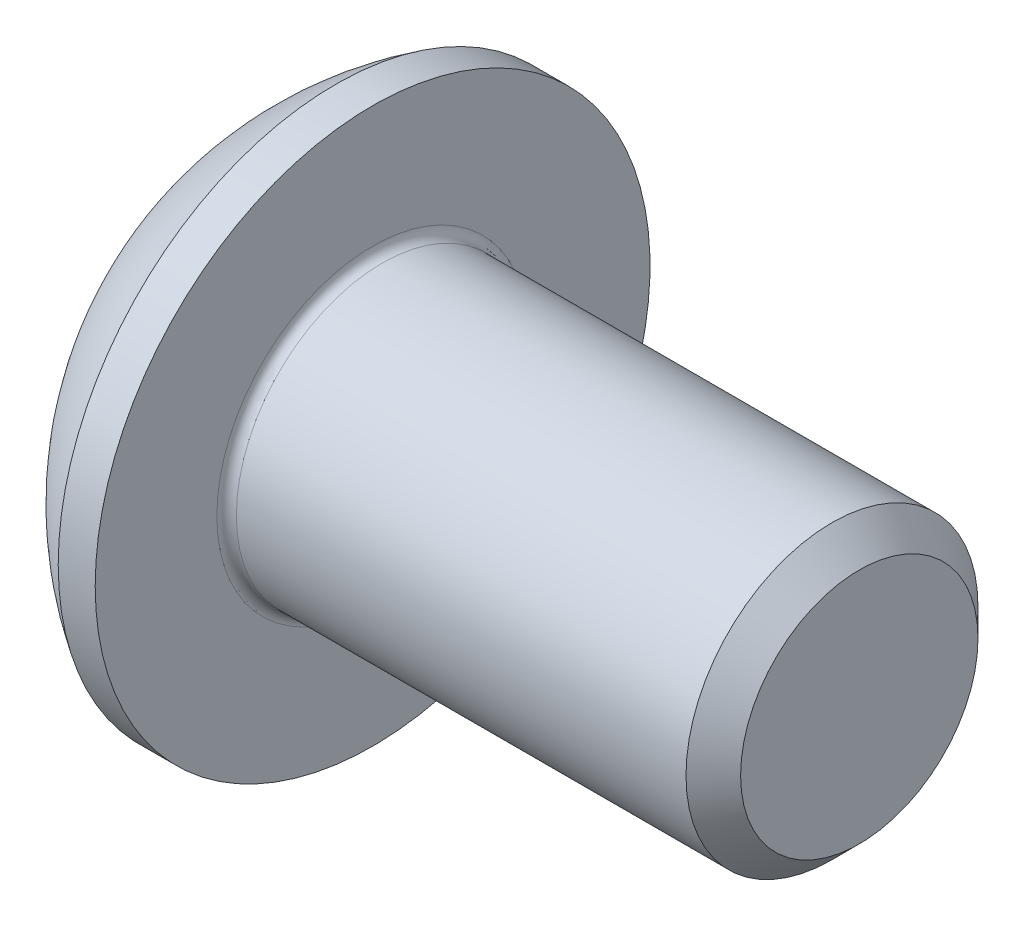
ISO-10303-21;
HEADER;
FILE_DESCRIPTION(('STEP AP214'),'2;1');
FILE_NAME('part.step','',(''),(''),'','','');
FILE_SCHEMA(('AUTOMOTIVE_DESIGN { 1 0 10303 214 1 1 1 1 }'));
ENDSEC;
DATA;
#1=APPLICATION_CONTEXT('core data for automotive mechanical design processes');
#2=APPLICATION_PROTOCOL_DEFINITION('international standard','automotive_design',2000,#1);
#3=PRODUCT_CONTEXT('',#1,'mechanical');
#4=PRODUCT('Part','Part','',(#3));
#5=PRODUCT_RELATED_PRODUCT_CATEGORY('part','',(#4));
#6=PRODUCT_DEFINITION_FORMATION('','',#4);
#7=PRODUCT_DEFINITION_CONTEXT('part definition',#1,'design');
#8=PRODUCT_DEFINITION('design','',#6,#7);
#9=PRODUCT_DEFINITION_SHAPE('','',#8);
#10=(LENGTH_UNIT() NAMED_UNIT(*) SI_UNIT(.MILLI.,.METRE.));
#11=(NAMED_UNIT(*) PLANE_ANGLE_UNIT() SI_UNIT($,.RADIAN.));
#12=(NAMED_UNIT(*) SI_UNIT($,.STERADIAN.) SOLID_ANGLE_UNIT());
#13=UNCERTAINTY_MEASURE_WITH_UNIT(LENGTH_MEASURE(1.E-05),#10,'distance_accuracy_value','');
#14=(GEOMETRIC_REPRESENTATION_CONTEXT(3) GLOBAL_UNCERTAINTY_ASSIGNED_CONTEXT((#13)) GLOBAL_UNIT_ASSIGNED_CONTEXT((#10,
#11,#12)) REPRESENTATION_CONTEXT('',''));
#15=CARTESIAN_POINT('',(0.,0.,0.));
#16=DIRECTION('',(0.,0.,1.));
#17=DIRECTION('',(1.,0.,0.));
#18=AXIS2_PLACEMENT_3D('',#15,#16,#17);
#19=CARTESIAN_POINT('',(0.,0.,0.));
#20=DIRECTION('',(-1.,0.,0.));
#21=DIRECTION('',(0.,0.,1.));
#22=AXIS2_PLACEMENT_3D('',#19,#20,#21);
#23=PLANE('',#22);
#24=CARTESIAN_POINT('',(0.,0.,0.));
#25=DIRECTION('',(-1.,0.,0.));
#26=DIRECTION('',(0.,0.,1.));
#27=AXIS2_PLACEMENT_3D('',#24,#25,#26);
#28=CIRCLE('',#27,1.425);
#29=CARTESIAN_POINT('',(0.,0.,1.425));
#30=VERTEX_POINT('',#29);
#31=EDGE_CURVE('E162',#30,#30,#28,.T.);
#32=ORIENTED_EDGE('',*,*,#31,.T.);
#33=EDGE_LOOP('',(#32));
#34=FACE_BOUND('',#33,.T.);
#35=DIRECTION('',(0.,-1.,0.));
#36=VECTOR('',#35,1.);
#37=CARTESIAN_POINT('',(0.,-0.577350269189625,1.));
#38=LINE('',#37,#36);
#39=CARTESIAN_POINT('',(0.,0.577350269189626,1.));
#40=VERTEX_POINT('',#39);
#41=CARTESIAN_POINT('',(0.,-0.577350269189625,1.));
#42=VERTEX_POINT('',#41);
#43=EDGE_CURVE('E52',#40,#42,#38,.T.);
#44=ORIENTED_EDGE('',*,*,#43,.T.);
#45=DIRECTION('',(0.,-0.5,-0.866025403784439));
#46=VECTOR('',#45,1.);
#47=CARTESIAN_POINT('',(0.,-1.15470053837925,0.));
#48=LINE('',#47,#46);
#49=CARTESIAN_POINT('',(0.,-1.15470053837925,0.));
#50=VERTEX_POINT('',#49);
#51=EDGE_CURVE('E255',#42,#50,#48,.T.);
#52=ORIENTED_EDGE('',*,*,#51,.T.);
#53=DIRECTION('',(0.,0.5,-0.866025403784439));
#54=VECTOR('',#53,1.);
#55=CARTESIAN_POINT('',(0.,-0.577350269189625,-1.));
#56=LINE('',#55,#54);
#57=CARTESIAN_POINT('',(0.,-0.577350269189625,-1.));
#58=VERTEX_POINT('',#57);
#59=EDGE_CURVE('E137',#50,#58,#56,.T.);
#60=ORIENTED_EDGE('',*,*,#59,.T.);
#61=DIRECTION('',(0.,1.,0.));
#62=VECTOR('',#61,1.);
#63=CARTESIAN_POINT('',(0.,0.577350269189626,-1.));
#64=LINE('',#63,#62);
#65=CARTESIAN_POINT('',(0.,0.577350269189626,-1.));
#66=VERTEX_POINT('',#65);
#67=EDGE_CURVE('E258',#58,#66,#64,.T.);
#68=ORIENTED_EDGE('',*,*,#67,.T.);
#69=DIRECTION('',(0.,0.5,0.866025403784438));
#70=VECTOR('',#69,1.);
#71=CARTESIAN_POINT('',(0.,1.15470053837925,0.));
#72=LINE('',#71,#70);
#73=CARTESIAN_POINT('',(0.,1.15470053837925,0.));
#74=VERTEX_POINT('',#73);
#75=EDGE_CURVE('E260',#66,#74,#72,.T.);
#76=ORIENTED_EDGE('',*,*,#75,.T.);
#77=DIRECTION('',(0.,-0.5,0.866025403784438));
#78=VECTOR('',#77,1.);
#79=CARTESIAN_POINT('',(0.,0.577350269189626,1.));
#80=LINE('',#79,#78);
#81=EDGE_CURVE('E262',#74,#40,#80,.T.);
#82=ORIENTED_EDGE('',*,*,#81,.T.);
#83=EDGE_LOOP('',(#44,#52,#60,#68,#76,#82));
#84=FACE_BOUND('',#83,.T.);
#85=ADVANCED_FACE('F37',(#34,#84),#23,.T.);
#86=CARTESIAN_POINT('',(3.03337598425197,0.,0.));
#87=DIRECTION('',(-1.,0.,0.));
#88=DIRECTION('',(0.,1.,0.));
#89=AXIS2_PLACEMENT_3D('',#86,#87,#88);
#90=SPHERICAL_SURFACE('',#89,3.35141684393878);
#91=CARTESIAN_POINT('',(1.27,0.,0.));
#92=DIRECTION('',(-1.,0.,0.));
#93=DIRECTION('',(0.,0.,1.));
#94=AXIS2_PLACEMENT_3D('',#91,#92,#93);
#95=CIRCLE('',#94,2.85);
#96=CARTESIAN_POINT('',(1.27,0.,2.85));
#97=VERTEX_POINT('',#96);
#98=EDGE_CURVE('E159',#97,#97,#95,.T.);
#99=ORIENTED_EDGE('',*,*,#98,.T.);
#100=EDGE_LOOP('',(#99));
#101=FACE_BOUND('',#100,.T.);
#102=ORIENTED_EDGE('',*,*,#31,.F.);
#103=EDGE_LOOP('',(#102));
#104=FACE_BOUND('',#103,.T.);
#105=ADVANCED_FACE('F183',(#101,#104),#90,.T.);
#106=CARTESIAN_POINT('',(0.,0.,0.));
#107=DIRECTION('',(-1.,0.,0.));
#108=DIRECTION('',(0.,0.,1.));
#109=AXIS2_PLACEMENT_3D('',#106,#107,#108);
#110=CYLINDRICAL_SURFACE('',#109,2.85);
#111=ORIENTED_EDGE('',*,*,#98,.F.);
#112=EDGE_LOOP('',(#111));
#113=FACE_BOUND('',#112,.T.);
#114=CARTESIAN_POINT('',(1.65,0.,0.));
#115=DIRECTION('',(-1.,0.,0.));
#116=DIRECTION('',(0.,0.,1.));
#117=AXIS2_PLACEMENT_3D('',#114,#115,#116);
#118=CIRCLE('',#117,2.85);
#119=CARTESIAN_POINT('',(1.65,0.,2.85));
#120=VERTEX_POINT('',#119);
#121=EDGE_CURVE('E156',#120,#120,#118,.T.);
#122=ORIENTED_EDGE('',*,*,#121,.T.);
#123=EDGE_LOOP('',(#122));
#124=FACE_BOUND('',#123,.T.);
#125=ADVANCED_FACE('F188',(#113,#124),#110,.T.);
#126=CARTESIAN_POINT('',(1.65,1.5,0.));
#127=DIRECTION('',(-1.,0.,0.));
#128=DIRECTION('',(0.,0.,1.));
#129=AXIS2_PLACEMENT_3D('',#126,#127,#128);
#130=PLANE('',#129);
#131=CARTESIAN_POINT('',(1.65,0.,0.));
#132=DIRECTION('',(-1.,0.,0.));
#133=DIRECTION('',(0.,0.,1.));
#134=AXIS2_PLACEMENT_3D('',#131,#132,#133);
#135=CIRCLE('',#134,1.6);
#136=CARTESIAN_POINT('',(1.65,0.,1.6));
#137=VERTEX_POINT('',#136);
#138=EDGE_CURVE('E45',#137,#137,#135,.T.);
#139=ORIENTED_EDGE('',*,*,#138,.T.);
#140=EDGE_LOOP('',(#139));
#141=FACE_BOUND('',#140,.T.);
#142=ORIENTED_EDGE('',*,*,#121,.F.);
#143=EDGE_LOOP('',(#142));
#144=FACE_BOUND('',#143,.T.);
#145=ADVANCED_FACE('F167',(#141,#144),#130,.F.);
#146=CARTESIAN_POINT('',(0.,0.,0.));
#147=DIRECTION('',(-1.,0.,0.));
#148=DIRECTION('',(0.,0.,1.));
#149=AXIS2_PLACEMENT_3D('',#146,#147,#148);
#150=CYLINDRICAL_SURFACE('',#149,1.5);
#151=CARTESIAN_POINT('',(1.75,0.,0.));
#152=DIRECTION('',(-1.,0.,0.));
#153=DIRECTION('',(0.,0.,1.));
#154=AXIS2_PLACEMENT_3D('',#151,#152,#153);
#155=CIRCLE('',#154,1.5);
#156=CARTESIAN_POINT('',(1.75,0.,1.5));
#157=VERTEX_POINT('',#156);
#158=EDGE_CURVE('E11',#157,#157,#155,.F.);
#159=ORIENTED_EDGE('',*,*,#158,.T.);
#160=EDGE_LOOP('',(#159));
#161=FACE_BOUND('',#160,.T.);
#162=CARTESIAN_POINT('',(6.3695,0.,0.));
#163=DIRECTION('',(-1.,0.,0.));
#164=DIRECTION('',(0.,0.,1.));
#165=AXIS2_PLACEMENT_3D('',#162,#163,#164);
#166=CIRCLE('',#165,1.5);
#167=CARTESIAN_POINT('',(6.3695,0.,1.5));
#168=VERTEX_POINT('',#167);
#169=EDGE_CURVE('E153',#168,#168,#166,.T.);
#170=ORIENTED_EDGE('',*,*,#169,.T.);
#171=EDGE_LOOP('',(#170));
#172=FACE_BOUND('',#171,.T.);
#173=ADVANCED_FACE('F197',(#161,#172),#150,.T.);
#174=CARTESIAN_POINT('',(6.65,0.,0.));
#175=DIRECTION('',(-1.,0.,0.));
#176=DIRECTION('',(0.,0.,1.));
#177=AXIS2_PLACEMENT_3D('',#174,#175,#176);
#178=CONICAL_SURFACE('',#177,1.2195,0.785398163397447);
#179=ORIENTED_EDGE('',*,*,#169,.F.);
#180=EDGE_LOOP('',(#179));
#181=FACE_BOUND('',#180,.T.);
#182=CARTESIAN_POINT('',(6.65,0.,0.));
#183=DIRECTION('',(-1.,0.,0.));
#184=DIRECTION('',(0.,0.,1.));
#185=AXIS2_PLACEMENT_3D('',#182,#183,#184);
#186=CIRCLE('',#185,1.2195);
#187=CARTESIAN_POINT('',(6.65,0.,1.2195));
#188=VERTEX_POINT('',#187);
#189=EDGE_CURVE('E149',#188,#188,#186,.T.);
#190=ORIENTED_EDGE('',*,*,#189,.T.);
#191=EDGE_LOOP('',(#190));
#192=FACE_BOUND('',#191,.T.);
#193=ADVANCED_FACE('F178',(#181,#192),#178,.T.);
#194=CARTESIAN_POINT('',(6.65,0.,0.));
#195=DIRECTION('',(-1.,0.,0.));
#196=DIRECTION('',(0.,0.,1.));
#197=AXIS2_PLACEMENT_3D('',#194,#195,#196);
#198=PLANE('',#197);
#199=ORIENTED_EDGE('',*,*,#189,.F.);
#200=EDGE_LOOP('',(#199));
#201=FACE_BOUND('',#200,.T.);
#202=ADVANCED_FACE('F171',(#201),#198,.F.);
#203=CARTESIAN_POINT('',(1.75,0.,0.));
#204=DIRECTION('',(-1.,0.,0.));
#205=DIRECTION('',(0.,0.,1.));
#206=AXIS2_PLACEMENT_3D('',#203,#204,#205);
#207=TOROIDAL_SURFACE('',#206,1.6,0.1);
#208=ORIENTED_EDGE('',*,*,#158,.F.);
#209=EDGE_LOOP('',(#208));
#210=FACE_BOUND('',#209,.T.);
#211=ORIENTED_EDGE('',*,*,#138,.F.);
#212=EDGE_LOOP('',(#211));
#213=FACE_BOUND('',#212,.T.);
#214=ADVANCED_FACE('F39',(#210,#213),#207,.F.);
#215=CARTESIAN_POINT('',(1.04,-1.15470053837925,0.));
#216=DIRECTION('',(0.,0.866025403784439,-0.5));
#217=DIRECTION('',(0.,0.5,0.866025403784439));
#218=AXIS2_PLACEMENT_3D('',#215,#216,#217);
#219=PLANE('',#218);
#220=DIRECTION('',(0.,-0.5,-0.866025403784439));
#221=VECTOR('',#220,1.);
#222=CARTESIAN_POINT('',(1.04,-1.15470053837925,0.));
#223=LINE('',#222,#221);
#224=CARTESIAN_POINT('',(1.04,-0.577350269189625,1.));
#225=VERTEX_POINT('',#224);
#226=CARTESIAN_POINT('',(1.04,-0.866025403784438,0.5));
#227=VERTEX_POINT('',#226);
#228=EDGE_CURVE('E120',#225,#227,#223,.T.);
#229=ORIENTED_EDGE('',*,*,#228,.T.);
#230=CARTESIAN_POINT('',(1.04,-1.15470053837925,0.));
#231=VERTEX_POINT('',#230);
#232=EDGE_CURVE('E113',#227,#231,#223,.T.);
#233=ORIENTED_EDGE('',*,*,#232,.T.);
#234=DIRECTION('',(-1.,0.,0.));
#235=VECTOR('',#234,1.);
#236=CARTESIAN_POINT('',(1.04,-1.15470053837925,0.));
#237=LINE('',#236,#235);
#238=EDGE_CURVE('E117',#231,#50,#237,.T.);
#239=ORIENTED_EDGE('',*,*,#238,.T.);
#240=ORIENTED_EDGE('',*,*,#51,.F.);
#241=DIRECTION('',(-1.,0.,0.));
#242=VECTOR('',#241,1.);
#243=CARTESIAN_POINT('',(1.04,-0.577350269189625,1.));
#244=LINE('',#243,#242);
#245=EDGE_CURVE('E245',#225,#42,#244,.T.);
#246=ORIENTED_EDGE('',*,*,#245,.F.);
#247=EDGE_LOOP('',(#229,#233,#239,#240,#246));
#248=FACE_BOUND('',#247,.T.);
#249=ADVANCED_FACE('F115',(#248),#219,.T.);
#250=CARTESIAN_POINT('',(1.04,-0.577350269189625,-1.));
#251=DIRECTION('',(0.,0.866025403784439,0.5));
#252=DIRECTION('',(0.,-0.5,0.866025403784439));
#253=AXIS2_PLACEMENT_3D('',#250,#251,#252);
#254=PLANE('',#253);
#255=DIRECTION('',(0.,0.5,-0.866025403784439));
#256=VECTOR('',#255,1.);
#257=CARTESIAN_POINT('',(1.04,-0.577350269189625,-1.));
#258=LINE('',#257,#256);
#259=CARTESIAN_POINT('',(1.04,-0.866025403784438,-0.5));
#260=VERTEX_POINT('',#259);
#261=EDGE_CURVE('E125',#231,#260,#258,.T.);
#262=ORIENTED_EDGE('',*,*,#261,.T.);
#263=CARTESIAN_POINT('',(1.04,-0.577350269189625,-1.));
#264=VERTEX_POINT('',#263);
#265=EDGE_CURVE('E132',#260,#264,#258,.T.);
#266=ORIENTED_EDGE('',*,*,#265,.T.);
#267=DIRECTION('',(-1.,0.,0.));
#268=VECTOR('',#267,1.);
#269=CARTESIAN_POINT('',(1.04,-0.577350269189625,-1.));
#270=LINE('',#269,#268);
#271=EDGE_CURVE('E139',#264,#58,#270,.T.);
#272=ORIENTED_EDGE('',*,*,#271,.T.);
#273=ORIENTED_EDGE('',*,*,#59,.F.);
#274=ORIENTED_EDGE('',*,*,#238,.F.);
#275=EDGE_LOOP('',(#262,#266,#272,#273,#274));
#276=FACE_BOUND('',#275,.T.);
#277=ADVANCED_FACE('F135',(#276),#254,.T.);
#278=CARTESIAN_POINT('',(1.04,0.577350269189626,-1.));
#279=DIRECTION('',(0.,0.,1.));
#280=DIRECTION('',(1.,0.,0.));
#281=AXIS2_PLACEMENT_3D('',#278,#279,#280);
#282=PLANE('',#281);
#283=DIRECTION('',(0.,1.,0.));
#284=VECTOR('',#283,1.);
#285=CARTESIAN_POINT('',(1.04,0.577350269189626,-1.));
#286=LINE('',#285,#284);
#287=CARTESIAN_POINT('',(1.04,0.,-1.));
#288=VERTEX_POINT('',#287);
#289=EDGE_CURVE('E281',#264,#288,#286,.T.);
#290=ORIENTED_EDGE('',*,*,#289,.T.);
#291=CARTESIAN_POINT('',(1.04,0.577350269189626,-1.));
#292=VERTEX_POINT('',#291);
#293=EDGE_CURVE('E131',#288,#292,#286,.T.);
#294=ORIENTED_EDGE('',*,*,#293,.T.);
#295=DIRECTION('',(-1.,0.,0.));
#296=VECTOR('',#295,1.);
#297=CARTESIAN_POINT('',(1.04,0.577350269189626,-1.));
#298=LINE('',#297,#296);
#299=EDGE_CURVE('E144',#292,#66,#298,.T.);
#300=ORIENTED_EDGE('',*,*,#299,.T.);
#301=ORIENTED_EDGE('',*,*,#67,.F.);
#302=ORIENTED_EDGE('',*,*,#271,.F.);
#303=EDGE_LOOP('',(#290,#294,#300,#301,#302));
#304=FACE_BOUND('',#303,.T.);
#305=ADVANCED_FACE('F211',(#304),#282,.T.);
#306=CARTESIAN_POINT('',(1.04,1.15470053837925,0.));
#307=DIRECTION('',(0.,-0.866025403784438,0.5));
#308=DIRECTION('',(0.,-0.5,-0.866025403784439));
#309=AXIS2_PLACEMENT_3D('',#306,#307,#308);
#310=PLANE('',#309);
#311=DIRECTION('',(0.,0.5,0.866025403784438));
#312=VECTOR('',#311,1.);
#313=CARTESIAN_POINT('',(1.04,1.15470053837925,0.));
#314=LINE('',#313,#312);
#315=CARTESIAN_POINT('',(1.04,0.866025403784439,-0.5));
#316=VERTEX_POINT('',#315);
#317=EDGE_CURVE('E287',#292,#316,#314,.T.);
#318=ORIENTED_EDGE('',*,*,#317,.T.);
#319=CARTESIAN_POINT('',(1.04,1.15470053837925,0.));
#320=VERTEX_POINT('',#319);
#321=EDGE_CURVE('E285',#316,#320,#314,.T.);
#322=ORIENTED_EDGE('',*,*,#321,.T.);
#323=DIRECTION('',(-1.,0.,0.));
#324=VECTOR('',#323,1.);
#325=CARTESIAN_POINT('',(1.04,1.15470053837925,0.));
#326=LINE('',#325,#324);
#327=EDGE_CURVE('E267',#320,#74,#326,.T.);
#328=ORIENTED_EDGE('',*,*,#327,.T.);
#329=ORIENTED_EDGE('',*,*,#75,.F.);
#330=ORIENTED_EDGE('',*,*,#299,.F.);
#331=EDGE_LOOP('',(#318,#322,#328,#329,#330));
#332=FACE_BOUND('',#331,.T.);
#333=ADVANCED_FACE('F214',(#332),#310,.T.);
#334=CARTESIAN_POINT('',(1.04,0.577350269189626,1.));
#335=DIRECTION('',(0.,-0.866025403784439,-0.5));
#336=DIRECTION('',(0.,0.5,-0.866025403784438));
#337=AXIS2_PLACEMENT_3D('',#334,#335,#336);
#338=PLANE('',#337);
#339=DIRECTION('',(0.,-0.5,0.866025403784438));
#340=VECTOR('',#339,1.);
#341=CARTESIAN_POINT('',(1.04,0.577350269189626,1.));
#342=LINE('',#341,#340);
#343=CARTESIAN_POINT('',(1.04,0.866025403784439,0.500000000000001));
#344=VERTEX_POINT('',#343);
#345=EDGE_CURVE('E251',#320,#344,#342,.T.);
#346=ORIENTED_EDGE('',*,*,#345,.T.);
#347=CARTESIAN_POINT('',(1.04,0.577350269189626,1.));
#348=VERTEX_POINT('',#347);
#349=EDGE_CURVE('E243',#344,#348,#342,.T.);
#350=ORIENTED_EDGE('',*,*,#349,.T.);
#351=DIRECTION('',(-1.,0.,0.));
#352=VECTOR('',#351,1.);
#353=CARTESIAN_POINT('',(1.04,0.577350269189626,1.));
#354=LINE('',#353,#352);
#355=EDGE_CURVE('E249',#348,#40,#354,.T.);
#356=ORIENTED_EDGE('',*,*,#355,.T.);
#357=ORIENTED_EDGE('',*,*,#81,.F.);
#358=ORIENTED_EDGE('',*,*,#327,.F.);
#359=EDGE_LOOP('',(#346,#350,#356,#357,#358));
#360=FACE_BOUND('',#359,.T.);
#361=ADVANCED_FACE('F218',(#360),#338,.T.);
#362=CARTESIAN_POINT('',(1.04,-0.577350269189625,1.));
#363=DIRECTION('',(0.,0.,-1.));
#364=DIRECTION('',(-1.,0.,0.));
#365=AXIS2_PLACEMENT_3D('',#362,#363,#364);
#366=PLANE('',#365);
#367=DIRECTION('',(0.,-1.,0.));
#368=VECTOR('',#367,1.);
#369=CARTESIAN_POINT('',(1.04,-0.577350269189625,1.));
#370=LINE('',#369,#368);
#371=CARTESIAN_POINT('',(1.04,0.,1.));
#372=VERTEX_POINT('',#371);
#373=EDGE_CURVE('E60',#348,#372,#370,.T.);
#374=ORIENTED_EDGE('',*,*,#373,.T.);
#375=EDGE_CURVE('E246',#372,#225,#370,.T.);
#376=ORIENTED_EDGE('',*,*,#375,.T.);
#377=ORIENTED_EDGE('',*,*,#245,.T.);
#378=ORIENTED_EDGE('',*,*,#43,.F.);
#379=ORIENTED_EDGE('',*,*,#355,.F.);
#380=EDGE_LOOP('',(#374,#376,#377,#378,#379));
#381=FACE_BOUND('',#380,.T.);
#382=ADVANCED_FACE('F222',(#381),#366,.T.);
#383=CARTESIAN_POINT('',(1.04,0.,2.));
#384=DIRECTION('',(-1.,0.,0.));
#385=DIRECTION('',(0.,0.,1.));
#386=AXIS2_PLACEMENT_3D('',#383,#384,#385);
#387=PLANE('',#386);
#388=ORIENTED_EDGE('',*,*,#373,.F.);
#389=ORIENTED_EDGE('',*,*,#349,.F.);
#390=CARTESIAN_POINT('',(1.04,0.,0.));
#391=DIRECTION('',(-1.,0.,0.));
#392=DIRECTION('',(0.,0.,1.));
#393=AXIS2_PLACEMENT_3D('',#390,#391,#392);
#394=CIRCLE('',#393,1.);
#395=EDGE_CURVE('E143',#372,#344,#394,.T.);
#396=ORIENTED_EDGE('',*,*,#395,.F.);
#397=EDGE_LOOP('',(#388,#389,#396));
#398=FACE_BOUND('',#397,.T.);
#399=ADVANCED_FACE('F226',(#398),#387,.T.);
#400=ORIENTED_EDGE('',*,*,#345,.F.);
#401=ORIENTED_EDGE('',*,*,#321,.F.);
#402=EDGE_CURVE('E150',#344,#316,#394,.T.);
#403=ORIENTED_EDGE('',*,*,#402,.F.);
#404=EDGE_LOOP('',(#400,#401,#403));
#405=FACE_BOUND('',#404,.T.);
#406=ADVANCED_FACE('F234',(#405),#387,.T.);
#407=ORIENTED_EDGE('',*,*,#317,.F.);
#408=ORIENTED_EDGE('',*,*,#293,.F.);
#409=EDGE_CURVE('E292',#316,#288,#394,.T.);
#410=ORIENTED_EDGE('',*,*,#409,.F.);
#411=EDGE_LOOP('',(#407,#408,#410));
#412=FACE_BOUND('',#411,.T.);
#413=ADVANCED_FACE('F239',(#412),#387,.T.);
#414=ORIENTED_EDGE('',*,*,#289,.F.);
#415=ORIENTED_EDGE('',*,*,#265,.F.);
#416=EDGE_CURVE('E284',#288,#260,#394,.T.);
#417=ORIENTED_EDGE('',*,*,#416,.F.);
#418=EDGE_LOOP('',(#414,#415,#417));
#419=FACE_BOUND('',#418,.T.);
#420=ADVANCED_FACE('F232',(#419),#387,.T.);
#421=ORIENTED_EDGE('',*,*,#261,.F.);
#422=ORIENTED_EDGE('',*,*,#232,.F.);
#423=EDGE_CURVE('E127',#260,#227,#394,.T.);
#424=ORIENTED_EDGE('',*,*,#423,.F.);
#425=EDGE_LOOP('',(#421,#422,#424));
#426=FACE_BOUND('',#425,.T.);
#427=ADVANCED_FACE('F126',(#426),#387,.T.);
#428=ORIENTED_EDGE('',*,*,#228,.F.);
#429=ORIENTED_EDGE('',*,*,#375,.F.);
#430=EDGE_CURVE('E138',#227,#372,#394,.T.);
#431=ORIENTED_EDGE('',*,*,#430,.F.);
#432=EDGE_LOOP('',(#428,#429,#431));
#433=FACE_BOUND('',#432,.T.);
#434=ADVANCED_FACE('F206',(#433),#387,.T.);
#435=CARTESIAN_POINT('',(1.61735026918963,0.,0.));
#436=DIRECTION('',(-1.,0.,0.));
#437=DIRECTION('',(0.,0.,1.));
#438=AXIS2_PLACEMENT_3D('',#435,#436,#437);
#439=CONICAL_SURFACE('',#438,0.,1.04719755119659);
#440=ORIENTED_EDGE('',*,*,#395,.T.);
#441=ORIENTED_EDGE('',*,*,#402,.T.);
#442=ORIENTED_EDGE('',*,*,#409,.T.);
#443=ORIENTED_EDGE('',*,*,#416,.T.);
#444=ORIENTED_EDGE('',*,*,#423,.T.);
#445=ORIENTED_EDGE('',*,*,#430,.T.);
#446=EDGE_LOOP('',(#440,#441,#442,#443,#444,#445));
#447=FACE_BOUND('',#446,.T.);
#448=CARTESIAN_POINT('',(1.61735026918963,0.,0.));
#449=VERTEX_POINT('',#448);
#450=VERTEX_LOOP('',#449);
#451=FACE_BOUND('',#450,.T.);
#452=ADVANCED_FACE('F204',(#447,#451),#439,.F.);
#453=CLOSED_SHELL('',(#85,#105,#125,#145,#173,#193,#202,#214,#249,#277,#305,#333,#361,#382,#399,
#406,#413,#420,#427,#434,#452));
#454=MANIFOLD_SOLID_BREP('B2',#453);
#455=ADVANCED_BREP_SHAPE_REPRESENTATION('',(#18,#454),#14);
#456=SHAPE_DEFINITION_REPRESENTATION(#9,#455);
ENDSEC;
END-ISO-10303-21;
